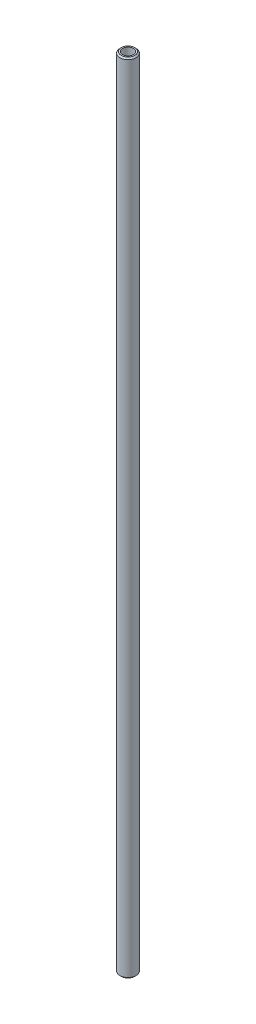
ISO-10303-21;
HEADER;
FILE_DESCRIPTION(('STEP AP214'),'2;1');
FILE_NAME('part.step','',(''),(''),'','','');
FILE_SCHEMA(('AUTOMOTIVE_DESIGN { 1 0 10303 214 1 1 1 1 }'));
ENDSEC;
DATA;
#1=APPLICATION_CONTEXT('core data for automotive mechanical design processes');
#2=APPLICATION_PROTOCOL_DEFINITION('international standard','automotive_design',2000,#1);
#3=PRODUCT_CONTEXT('',#1,'mechanical');
#4=PRODUCT('Part','Part','',(#3));
#5=PRODUCT_RELATED_PRODUCT_CATEGORY('part','',(#4));
#6=PRODUCT_DEFINITION_FORMATION('','',#4);
#7=PRODUCT_DEFINITION_CONTEXT('part definition',#1,'design');
#8=PRODUCT_DEFINITION('design','',#6,#7);
#9=PRODUCT_DEFINITION_SHAPE('','',#8);
#10=(LENGTH_UNIT() NAMED_UNIT(*) SI_UNIT(.MILLI.,.METRE.));
#11=(NAMED_UNIT(*) PLANE_ANGLE_UNIT() SI_UNIT($,.RADIAN.));
#12=(NAMED_UNIT(*) SI_UNIT($,.STERADIAN.) SOLID_ANGLE_UNIT());
#13=UNCERTAINTY_MEASURE_WITH_UNIT(LENGTH_MEASURE(1.E-05),#10,'distance_accuracy_value','');
#14=(GEOMETRIC_REPRESENTATION_CONTEXT(3) GLOBAL_UNCERTAINTY_ASSIGNED_CONTEXT((#13)) GLOBAL_UNIT_ASSIGNED_CONTEXT((#10,
#11,#12)) REPRESENTATION_CONTEXT('',''));
#15=CARTESIAN_POINT('',(0.,0.,0.));
#16=DIRECTION('',(0.,0.,1.));
#17=DIRECTION('',(1.,0.,0.));
#18=AXIS2_PLACEMENT_3D('',#15,#16,#17);
#19=CARTESIAN_POINT('',(5628.34277543716,295.,596.213783271176));
#20=DIRECTION('',(0.,1.,0.));
#21=DIRECTION('',(0.,0.,1.));
#22=AXIS2_PLACEMENT_3D('',#19,#20,#21);
#23=PLANE('',#22);
#24=CARTESIAN_POINT('',(5628.34277543716,295.,596.213783271176));
#25=DIRECTION('',(0.,1.,0.));
#26=DIRECTION('',(0.,0.,1.));
#27=AXIS2_PLACEMENT_3D('',#24,#25,#26);
#28=CIRCLE('',#27,2.50000000000017);
#29=CARTESIAN_POINT('',(5628.34277543716,295.,598.713783271176));
#30=VERTEX_POINT('',#29);
#31=EDGE_CURVE('E57',#30,#30,#28,.T.);
#32=ORIENTED_EDGE('',*,*,#31,.T.);
#33=EDGE_LOOP('',(#32));
#34=FACE_BOUND('',#33,.T.);
#35=CARTESIAN_POINT('',(5628.34277543716,295.,596.213783271176));
#36=DIRECTION('',(0.,1.,0.));
#37=DIRECTION('',(0.,0.,1.));
#38=AXIS2_PLACEMENT_3D('',#35,#36,#37);
#39=CIRCLE('',#38,2.00000000000007);
#40=CARTESIAN_POINT('',(5628.34277543716,295.,598.213783271176));
#41=VERTEX_POINT('',#40);
#42=EDGE_CURVE('E63',#41,#41,#39,.T.);
#43=ORIENTED_EDGE('',*,*,#42,.F.);
#44=EDGE_LOOP('',(#43));
#45=FACE_BOUND('',#44,.T.);
#46=ADVANCED_FACE('F36',(#34,#45),#23,.T.);
#47=CARTESIAN_POINT('',(5628.34277543716,0.,596.213783271176));
#48=DIRECTION('',(0.,1.,0.));
#49=DIRECTION('',(0.,0.,1.));
#50=AXIS2_PLACEMENT_3D('',#47,#48,#49);
#51=PLANE('',#50);
#52=CARTESIAN_POINT('',(5628.34277543716,0.,596.213783271176));
#53=DIRECTION('',(0.,1.,0.));
#54=DIRECTION('',(0.,0.,1.));
#55=AXIS2_PLACEMENT_3D('',#52,#53,#54);
#56=CIRCLE('',#55,2.50000000000017);
#57=CARTESIAN_POINT('',(5628.34277543716,0.,598.713783271176));
#58=VERTEX_POINT('',#57);
#59=EDGE_CURVE('E10',#58,#58,#56,.F.);
#60=ORIENTED_EDGE('',*,*,#59,.T.);
#61=EDGE_LOOP('',(#60));
#62=FACE_BOUND('',#61,.T.);
#63=CARTESIAN_POINT('',(5628.34277543716,0.,596.213783271176));
#64=DIRECTION('',(0.,1.,0.));
#65=DIRECTION('',(0.,0.,1.));
#66=AXIS2_PLACEMENT_3D('',#63,#64,#65);
#67=CIRCLE('',#66,2.00000000000007);
#68=CARTESIAN_POINT('',(5628.34277543716,0.,598.213783271176));
#69=VERTEX_POINT('',#68);
#70=EDGE_CURVE('E64',#69,#69,#67,.T.);
#71=ORIENTED_EDGE('',*,*,#70,.T.);
#72=EDGE_LOOP('',(#71));
#73=FACE_BOUND('',#72,.T.);
#74=ADVANCED_FACE('F74',(#62,#73),#51,.F.);
#75=CARTESIAN_POINT('',(5628.34277543716,295.,596.213783271176));
#76=DIRECTION('',(0.,-1.,0.));
#77=DIRECTION('',(0.,0.,-1.));
#78=AXIS2_PLACEMENT_3D('',#75,#76,#77);
#79=CYLINDRICAL_SURFACE('',#78,3.00000000000015);
#80=CARTESIAN_POINT('',(5628.34277543716,294.5,596.213783271176));
#81=DIRECTION('',(0.,1.,0.));
#82=DIRECTION('',(0.,0.,1.));
#83=AXIS2_PLACEMENT_3D('',#80,#81,#82);
#84=CIRCLE('',#83,3.00000000000015);
#85=CARTESIAN_POINT('',(5628.34277543716,294.5,599.213783271176));
#86=VERTEX_POINT('',#85);
#87=EDGE_CURVE('E45',#86,#86,#84,.F.);
#88=ORIENTED_EDGE('',*,*,#87,.T.);
#89=EDGE_LOOP('',(#88));
#90=FACE_BOUND('',#89,.T.);
#91=CARTESIAN_POINT('',(5628.34277543716,0.500000000000056,596.213783271176));
#92=DIRECTION('',(0.,1.,0.));
#93=DIRECTION('',(0.,0.,1.));
#94=AXIS2_PLACEMENT_3D('',#91,#92,#93);
#95=CIRCLE('',#94,3.00000000000015);
#96=CARTESIAN_POINT('',(5628.34277543716,0.500000000000056,599.213783271176));
#97=VERTEX_POINT('',#96);
#98=EDGE_CURVE('E52',#97,#97,#95,.T.);
#99=ORIENTED_EDGE('',*,*,#98,.T.);
#100=EDGE_LOOP('',(#99));
#101=FACE_BOUND('',#100,.T.);
#102=ADVANCED_FACE('F80',(#90,#101),#79,.T.);
#103=CARTESIAN_POINT('',(5628.34277543716,295.,596.213783271176));
#104=DIRECTION('',(0.,-1.,0.));
#105=DIRECTION('',(0.,0.,-1.));
#106=AXIS2_PLACEMENT_3D('',#103,#104,#105);
#107=CYLINDRICAL_SURFACE('',#106,2.00000000000007);
#108=ORIENTED_EDGE('',*,*,#42,.T.);
#109=EDGE_LOOP('',(#108));
#110=FACE_BOUND('',#109,.T.);
#111=ORIENTED_EDGE('',*,*,#70,.F.);
#112=EDGE_LOOP('',(#111));
#113=FACE_BOUND('',#112,.T.);
#114=ADVANCED_FACE('F70',(#110,#113),#107,.F.);
#115=CARTESIAN_POINT('',(5628.34277543716,295.,596.213783271176));
#116=DIRECTION('',(0.,-1.,0.));
#117=DIRECTION('',(0.,0.,-1.));
#118=AXIS2_PLACEMENT_3D('',#115,#116,#117);
#119=CONICAL_SURFACE('',#118,2.50000000000017,0.785398163397433);
#120=ORIENTED_EDGE('',*,*,#87,.F.);
#121=EDGE_LOOP('',(#120));
#122=FACE_BOUND('',#121,.T.);
#123=ORIENTED_EDGE('',*,*,#31,.F.);
#124=EDGE_LOOP('',(#123));
#125=FACE_BOUND('',#124,.T.);
#126=ADVANCED_FACE('F86',(#122,#125),#119,.T.);
#127=CARTESIAN_POINT('',(5628.34277543716,0.500000000000056,596.213783271176));
#128=DIRECTION('',(0.,1.,0.));
#129=DIRECTION('',(0.,0.,1.));
#130=AXIS2_PLACEMENT_3D('',#127,#128,#129);
#131=CONICAL_SURFACE('',#130,3.00000000000015,0.785398163397378);
#132=ORIENTED_EDGE('',*,*,#59,.F.);
#133=EDGE_LOOP('',(#132));
#134=FACE_BOUND('',#133,.T.);
#135=ORIENTED_EDGE('',*,*,#98,.F.);
#136=EDGE_LOOP('',(#135));
#137=FACE_BOUND('',#136,.T.);
#138=ADVANCED_FACE('F39',(#134,#137),#131,.T.);
#139=CLOSED_SHELL('',(#46,#74,#102,#114,#126,#138));
#140=MANIFOLD_SOLID_BREP('B2',#139);
#141=ADVANCED_BREP_SHAPE_REPRESENTATION('',(#18,#140),#14);
#142=SHAPE_DEFINITION_REPRESENTATION(#9,#141);
ENDSEC;
END-ISO-10303-21;
